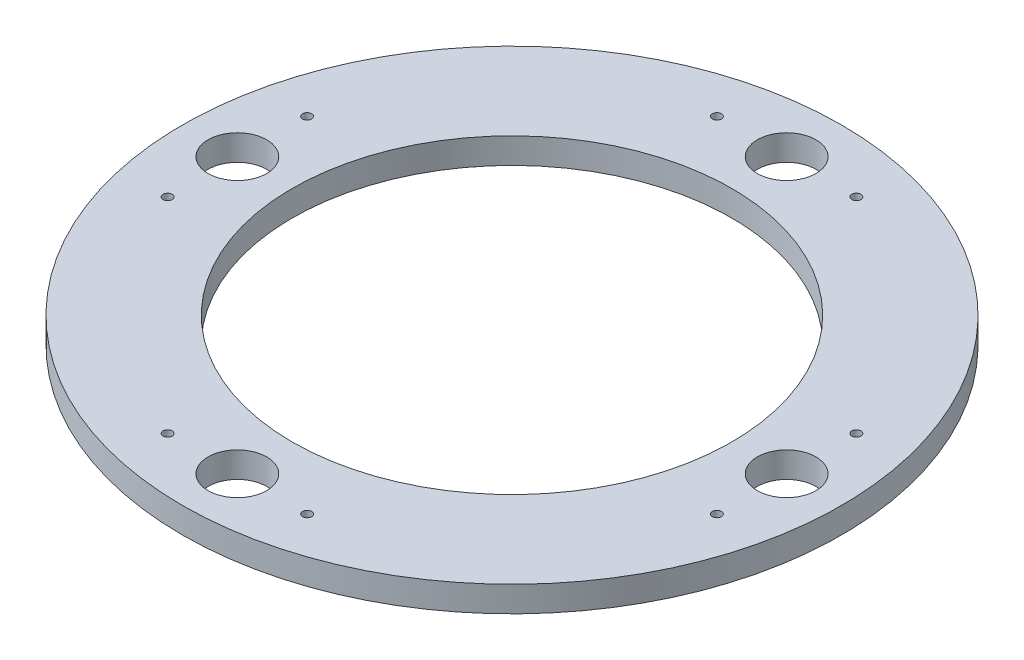
ISO-10303-21;
HEADER;
FILE_DESCRIPTION(('STEP AP214'),'2;1');
FILE_NAME('part.step','',(''),(''),'','','');
FILE_SCHEMA(('AUTOMOTIVE_DESIGN { 1 0 10303 214 1 1 1 1 }'));
ENDSEC;
DATA;
#1=APPLICATION_CONTEXT('core data for automotive mechanical design processes');
#2=APPLICATION_PROTOCOL_DEFINITION('international standard','automotive_design',2000,#1);
#3=PRODUCT_CONTEXT('',#1,'mechanical');
#4=PRODUCT('Part','Part','',(#3));
#5=PRODUCT_RELATED_PRODUCT_CATEGORY('part','',(#4));
#6=PRODUCT_DEFINITION_FORMATION('','',#4);
#7=PRODUCT_DEFINITION_CONTEXT('part definition',#1,'design');
#8=PRODUCT_DEFINITION('design','',#6,#7);
#9=PRODUCT_DEFINITION_SHAPE('','',#8);
#10=(LENGTH_UNIT() NAMED_UNIT(*) SI_UNIT(.MILLI.,.METRE.));
#11=(NAMED_UNIT(*) PLANE_ANGLE_UNIT() SI_UNIT($,.RADIAN.));
#12=(NAMED_UNIT(*) SI_UNIT($,.STERADIAN.) SOLID_ANGLE_UNIT());
#13=UNCERTAINTY_MEASURE_WITH_UNIT(LENGTH_MEASURE(1.E-05),#10,'distance_accuracy_value','');
#14=(GEOMETRIC_REPRESENTATION_CONTEXT(3) GLOBAL_UNCERTAINTY_ASSIGNED_CONTEXT((#13)) GLOBAL_UNIT_ASSIGNED_CONTEXT((#10,
#11,#12)) REPRESENTATION_CONTEXT('',''));
#15=CARTESIAN_POINT('',(0.,0.,0.));
#16=DIRECTION('',(0.,0.,1.));
#17=DIRECTION('',(1.,0.,0.));
#18=AXIS2_PLACEMENT_3D('',#15,#16,#17);
#19=CARTESIAN_POINT('',(0.,7.,0.));
#20=DIRECTION('',(0.,-1.,0.));
#21=DIRECTION('',(0.,0.,-1.));
#22=AXIS2_PLACEMENT_3D('',#19,#20,#21);
#23=CYLINDRICAL_SURFACE('',#22,90.);
#24=CARTESIAN_POINT('',(0.,7.,0.));
#25=DIRECTION('',(0.,1.,0.));
#26=DIRECTION('',(0.,0.,1.));
#27=AXIS2_PLACEMENT_3D('',#24,#25,#26);
#28=CIRCLE('',#27,90.);
#29=CARTESIAN_POINT('',(0.,7.,90.));
#30=VERTEX_POINT('',#29);
#31=EDGE_CURVE('E10',#30,#30,#28,.T.);
#32=ORIENTED_EDGE('',*,*,#31,.F.);
#33=EDGE_LOOP('',(#32));
#34=FACE_BOUND('',#33,.T.);
#35=CARTESIAN_POINT('',(0.,0.,0.));
#36=DIRECTION('',(0.,1.,0.));
#37=DIRECTION('',(0.,0.,1.));
#38=AXIS2_PLACEMENT_3D('',#35,#36,#37);
#39=CIRCLE('',#38,90.);
#40=CARTESIAN_POINT('',(0.,0.,90.));
#41=VERTEX_POINT('',#40);
#42=EDGE_CURVE('E39',#41,#41,#39,.T.);
#43=ORIENTED_EDGE('',*,*,#42,.T.);
#44=EDGE_LOOP('',(#43));
#45=FACE_BOUND('',#44,.T.);
#46=ADVANCED_FACE('F36',(#34,#45),#23,.T.);
#47=CARTESIAN_POINT('',(0.,7.,0.));
#48=DIRECTION('',(0.,1.,0.));
#49=DIRECTION('',(0.,0.,1.));
#50=AXIS2_PLACEMENT_3D('',#47,#48,#49);
#51=PLANE('',#50);
#52=CARTESIAN_POINT('',(0.,7.,0.));
#53=DIRECTION('',(0.,1.,0.));
#54=DIRECTION('',(0.,0.,1.));
#55=AXIS2_PLACEMENT_3D('',#52,#53,#54);
#56=CIRCLE('',#55,60.);
#57=CARTESIAN_POINT('',(0.,7.,60.));
#58=VERTEX_POINT('',#57);
#59=EDGE_CURVE('E120',#58,#58,#56,.T.);
#60=ORIENTED_EDGE('',*,*,#59,.F.);
#61=EDGE_LOOP('',(#60));
#62=FACE_BOUND('',#61,.T.);
#63=CARTESIAN_POINT('',(-75.0000000000002,7.,19.0499999999992));
#64=DIRECTION('',(0.,1.,0.));
#65=DIRECTION('',(0.,0.,1.));
#66=AXIS2_PLACEMENT_3D('',#63,#64,#65);
#67=CIRCLE('',#66,1.25);
#68=CARTESIAN_POINT('',(-75.0000000000002,7.,20.2999999999992));
#69=VERTEX_POINT('',#68);
#70=EDGE_CURVE('E116',#69,#69,#67,.T.);
#71=ORIENTED_EDGE('',*,*,#70,.F.);
#72=EDGE_LOOP('',(#71));
#73=FACE_BOUND('',#72,.T.);
#74=CARTESIAN_POINT('',(-74.9999999999998,7.,-19.0500000000008));
#75=DIRECTION('',(0.,1.,0.));
#76=DIRECTION('',(0.,0.,1.));
#77=AXIS2_PLACEMENT_3D('',#74,#75,#76);
#78=CIRCLE('',#77,1.25);
#79=CARTESIAN_POINT('',(-74.9999999999998,7.,-17.8000000000008));
#80=VERTEX_POINT('',#79);
#81=EDGE_CURVE('E110',#80,#80,#78,.T.);
#82=ORIENTED_EDGE('',*,*,#81,.F.);
#83=EDGE_LOOP('',(#82));
#84=FACE_BOUND('',#83,.T.);
#85=CARTESIAN_POINT('',(19.05,7.,75.));
#86=DIRECTION('',(0.,1.,0.));
#87=DIRECTION('',(0.,0.,1.));
#88=AXIS2_PLACEMENT_3D('',#85,#86,#87);
#89=CIRCLE('',#88,1.25);
#90=CARTESIAN_POINT('',(19.05,7.,76.25));
#91=VERTEX_POINT('',#90);
#92=EDGE_CURVE('E104',#91,#91,#89,.T.);
#93=ORIENTED_EDGE('',*,*,#92,.F.);
#94=EDGE_LOOP('',(#93));
#95=FACE_BOUND('',#94,.T.);
#96=CARTESIAN_POINT('',(-19.05,7.,75.));
#97=DIRECTION('',(0.,1.,0.));
#98=DIRECTION('',(0.,0.,1.));
#99=AXIS2_PLACEMENT_3D('',#96,#97,#98);
#100=CIRCLE('',#99,1.25);
#101=CARTESIAN_POINT('',(-19.05,7.,76.25));
#102=VERTEX_POINT('',#101);
#103=EDGE_CURVE('E98',#102,#102,#100,.T.);
#104=ORIENTED_EDGE('',*,*,#103,.F.);
#105=EDGE_LOOP('',(#104));
#106=FACE_BOUND('',#105,.T.);
#107=CARTESIAN_POINT('',(75.0000000000001,7.,-19.0499999999997));
#108=DIRECTION('',(0.,1.,0.));
#109=DIRECTION('',(0.,0.,1.));
#110=AXIS2_PLACEMENT_3D('',#107,#108,#109);
#111=CIRCLE('',#110,1.25);
#112=CARTESIAN_POINT('',(75.0000000000001,7.,-17.7999999999997));
#113=VERTEX_POINT('',#112);
#114=EDGE_CURVE('E92',#113,#113,#111,.T.);
#115=ORIENTED_EDGE('',*,*,#114,.F.);
#116=EDGE_LOOP('',(#115));
#117=FACE_BOUND('',#116,.T.);
#118=CARTESIAN_POINT('',(74.9999999999999,7.,19.0500000000003));
#119=DIRECTION('',(0.,1.,0.));
#120=DIRECTION('',(0.,0.,1.));
#121=AXIS2_PLACEMENT_3D('',#118,#119,#120);
#122=CIRCLE('',#121,1.25);
#123=CARTESIAN_POINT('',(74.9999999999999,7.,20.3000000000003));
#124=VERTEX_POINT('',#123);
#125=EDGE_CURVE('E86',#124,#124,#122,.T.);
#126=ORIENTED_EDGE('',*,*,#125,.F.);
#127=EDGE_LOOP('',(#126));
#128=FACE_BOUND('',#127,.T.);
#129=CARTESIAN_POINT('',(0.,7.,75.));
#130=DIRECTION('',(0.,1.,0.));
#131=DIRECTION('',(0.,0.,-1.));
#132=AXIS2_PLACEMENT_3D('',#129,#130,#131);
#133=CIRCLE('',#132,8.);
#134=CARTESIAN_POINT('',(0.,7.,67.));
#135=VERTEX_POINT('',#134);
#136=EDGE_CURVE('E79',#135,#135,#133,.T.);
#137=ORIENTED_EDGE('',*,*,#136,.F.);
#138=EDGE_LOOP('',(#137));
#139=FACE_BOUND('',#138,.T.);
#140=CARTESIAN_POINT('',(-75.,7.,-7.85583301239705E-13));
#141=DIRECTION('',(0.,1.,0.));
#142=DIRECTION('',(1.,0.,0.));
#143=AXIS2_PLACEMENT_3D('',#140,#141,#142);
#144=CIRCLE('',#143,8.);
#145=CARTESIAN_POINT('',(-67.,7.,-7.0178774910747E-13));
#146=VERTEX_POINT('',#145);
#147=EDGE_CURVE('E72',#146,#146,#144,.T.);
#148=ORIENTED_EDGE('',*,*,#147,.F.);
#149=EDGE_LOOP('',(#148));
#150=FACE_BOUND('',#149,.T.);
#151=CARTESIAN_POINT('',(75.,7.,2.61861100413235E-13));
#152=DIRECTION('',(0.,1.,0.));
#153=DIRECTION('',(-1.,0.,0.));
#154=AXIS2_PLACEMENT_3D('',#151,#152,#153);
#155=CIRCLE('',#154,8.);
#156=CARTESIAN_POINT('',(67.,7.,2.3392924970249E-13));
#157=VERTEX_POINT('',#156);
#158=EDGE_CURVE('E66',#157,#157,#155,.T.);
#159=ORIENTED_EDGE('',*,*,#158,.F.);
#160=EDGE_LOOP('',(#159));
#161=FACE_BOUND('',#160,.T.);
#162=CARTESIAN_POINT('',(-19.05,7.,-75.));
#163=DIRECTION('',(0.,1.,0.));
#164=DIRECTION('',(0.,0.,1.));
#165=AXIS2_PLACEMENT_3D('',#162,#163,#164);
#166=CIRCLE('',#165,1.25);
#167=CARTESIAN_POINT('',(-19.05,7.,-73.75));
#168=VERTEX_POINT('',#167);
#169=EDGE_CURVE('E62',#168,#168,#166,.T.);
#170=ORIENTED_EDGE('',*,*,#169,.F.);
#171=EDGE_LOOP('',(#170));
#172=FACE_BOUND('',#171,.T.);
#173=CARTESIAN_POINT('',(19.05,7.,-75.));
#174=DIRECTION('',(0.,1.,0.));
#175=DIRECTION('',(0.,0.,1.));
#176=AXIS2_PLACEMENT_3D('',#173,#174,#175);
#177=CIRCLE('',#176,1.25);
#178=CARTESIAN_POINT('',(19.05,7.,-73.75));
#179=VERTEX_POINT('',#178);
#180=EDGE_CURVE('E56',#179,#179,#177,.T.);
#181=ORIENTED_EDGE('',*,*,#180,.F.);
#182=EDGE_LOOP('',(#181));
#183=FACE_BOUND('',#182,.T.);
#184=CARTESIAN_POINT('',(0.,7.,-75.));
#185=DIRECTION('',(0.,1.,0.));
#186=DIRECTION('',(0.,0.,1.));
#187=AXIS2_PLACEMENT_3D('',#184,#185,#186);
#188=CIRCLE('',#187,8.);
#189=CARTESIAN_POINT('',(0.,7.,-67.));
#190=VERTEX_POINT('',#189);
#191=EDGE_CURVE('E48',#190,#190,#188,.T.);
#192=ORIENTED_EDGE('',*,*,#191,.F.);
#193=EDGE_LOOP('',(#192));
#194=FACE_BOUND('',#193,.T.);
#195=ORIENTED_EDGE('',*,*,#31,.T.);
#196=EDGE_LOOP('',(#195));
#197=FACE_BOUND('',#196,.T.);
#198=ADVANCED_FACE('F136',(#62,#73,#84,#95,#106,#117,#128,#139,#150,#161,#172,#183,#194,#197),
#51,.T.);
#199=CARTESIAN_POINT('',(0.,0.,0.));
#200=DIRECTION('',(0.,1.,0.));
#201=DIRECTION('',(0.,0.,1.));
#202=AXIS2_PLACEMENT_3D('',#199,#200,#201);
#203=PLANE('',#202);
#204=CARTESIAN_POINT('',(0.,0.,0.));
#205=DIRECTION('',(0.,1.,0.));
#206=DIRECTION('',(0.,0.,1.));
#207=AXIS2_PLACEMENT_3D('',#204,#205,#206);
#208=CIRCLE('',#207,60.);
#209=CARTESIAN_POINT('',(0.,0.,60.));
#210=VERTEX_POINT('',#209);
#211=EDGE_CURVE('E119',#210,#210,#208,.T.);
#212=ORIENTED_EDGE('',*,*,#211,.T.);
#213=EDGE_LOOP('',(#212));
#214=FACE_BOUND('',#213,.T.);
#215=CARTESIAN_POINT('',(-75.0000000000002,0.,19.0499999999992));
#216=DIRECTION('',(0.,1.,0.));
#217=DIRECTION('',(0.,0.,1.));
#218=AXIS2_PLACEMENT_3D('',#215,#216,#217);
#219=CIRCLE('',#218,1.25);
#220=CARTESIAN_POINT('',(-75.0000000000002,0.,20.2999999999992));
#221=VERTEX_POINT('',#220);
#222=EDGE_CURVE('E113',#221,#221,#219,.T.);
#223=ORIENTED_EDGE('',*,*,#222,.T.);
#224=EDGE_LOOP('',(#223));
#225=FACE_BOUND('',#224,.T.);
#226=CARTESIAN_POINT('',(-74.9999999999998,0.,-19.0500000000008));
#227=DIRECTION('',(0.,1.,0.));
#228=DIRECTION('',(0.,0.,1.));
#229=AXIS2_PLACEMENT_3D('',#226,#227,#228);
#230=CIRCLE('',#229,1.25);
#231=CARTESIAN_POINT('',(-74.9999999999998,0.,-17.8000000000008));
#232=VERTEX_POINT('',#231);
#233=EDGE_CURVE('E107',#232,#232,#230,.T.);
#234=ORIENTED_EDGE('',*,*,#233,.T.);
#235=EDGE_LOOP('',(#234));
#236=FACE_BOUND('',#235,.T.);
#237=CARTESIAN_POINT('',(19.05,0.,75.));
#238=DIRECTION('',(0.,1.,0.));
#239=DIRECTION('',(0.,0.,1.));
#240=AXIS2_PLACEMENT_3D('',#237,#238,#239);
#241=CIRCLE('',#240,1.25);
#242=CARTESIAN_POINT('',(19.05,0.,76.25));
#243=VERTEX_POINT('',#242);
#244=EDGE_CURVE('E101',#243,#243,#241,.T.);
#245=ORIENTED_EDGE('',*,*,#244,.T.);
#246=EDGE_LOOP('',(#245));
#247=FACE_BOUND('',#246,.T.);
#248=CARTESIAN_POINT('',(-19.05,0.,75.));
#249=DIRECTION('',(0.,1.,0.));
#250=DIRECTION('',(0.,0.,1.));
#251=AXIS2_PLACEMENT_3D('',#248,#249,#250);
#252=CIRCLE('',#251,1.25);
#253=CARTESIAN_POINT('',(-19.05,0.,76.25));
#254=VERTEX_POINT('',#253);
#255=EDGE_CURVE('E95',#254,#254,#252,.T.);
#256=ORIENTED_EDGE('',*,*,#255,.T.);
#257=EDGE_LOOP('',(#256));
#258=FACE_BOUND('',#257,.T.);
#259=CARTESIAN_POINT('',(75.0000000000001,0.,-19.0499999999997));
#260=DIRECTION('',(0.,1.,0.));
#261=DIRECTION('',(0.,0.,1.));
#262=AXIS2_PLACEMENT_3D('',#259,#260,#261);
#263=CIRCLE('',#262,1.25);
#264=CARTESIAN_POINT('',(75.0000000000001,0.,-17.7999999999997));
#265=VERTEX_POINT('',#264);
#266=EDGE_CURVE('E89',#265,#265,#263,.T.);
#267=ORIENTED_EDGE('',*,*,#266,.T.);
#268=EDGE_LOOP('',(#267));
#269=FACE_BOUND('',#268,.T.);
#270=CARTESIAN_POINT('',(74.9999999999999,0.,19.0500000000003));
#271=DIRECTION('',(0.,1.,0.));
#272=DIRECTION('',(0.,0.,1.));
#273=AXIS2_PLACEMENT_3D('',#270,#271,#272);
#274=CIRCLE('',#273,1.25);
#275=CARTESIAN_POINT('',(74.9999999999999,0.,20.3000000000003));
#276=VERTEX_POINT('',#275);
#277=EDGE_CURVE('E76',#276,#276,#274,.T.);
#278=ORIENTED_EDGE('',*,*,#277,.T.);
#279=EDGE_LOOP('',(#278));
#280=FACE_BOUND('',#279,.T.);
#281=CARTESIAN_POINT('',(0.,0.,75.));
#282=DIRECTION('',(0.,1.,0.));
#283=DIRECTION('',(0.,0.,-1.));
#284=AXIS2_PLACEMENT_3D('',#281,#282,#283);
#285=CIRCLE('',#284,8.);
#286=CARTESIAN_POINT('',(0.,0.,67.));
#287=VERTEX_POINT('',#286);
#288=EDGE_CURVE('E69',#287,#287,#285,.T.);
#289=ORIENTED_EDGE('',*,*,#288,.T.);
#290=EDGE_LOOP('',(#289));
#291=FACE_BOUND('',#290,.T.);
#292=CARTESIAN_POINT('',(-75.,0.,-7.85583301239705E-13));
#293=DIRECTION('',(0.,1.,0.));
#294=DIRECTION('',(1.,0.,0.));
#295=AXIS2_PLACEMENT_3D('',#292,#293,#294);
#296=CIRCLE('',#295,8.);
#297=CARTESIAN_POINT('',(-67.,0.,-7.0178774910747E-13));
#298=VERTEX_POINT('',#297);
#299=EDGE_CURVE('E75',#298,#298,#296,.T.);
#300=ORIENTED_EDGE('',*,*,#299,.T.);
#301=EDGE_LOOP('',(#300));
#302=FACE_BOUND('',#301,.T.);
#303=CARTESIAN_POINT('',(75.,0.,2.61861100413235E-13));
#304=DIRECTION('',(0.,1.,0.));
#305=DIRECTION('',(-1.,0.,0.));
#306=AXIS2_PLACEMENT_3D('',#303,#304,#305);
#307=CIRCLE('',#306,8.);
#308=CARTESIAN_POINT('',(67.,0.,2.3392924970249E-13));
#309=VERTEX_POINT('',#308);
#310=EDGE_CURVE('E65',#309,#309,#307,.T.);
#311=ORIENTED_EDGE('',*,*,#310,.T.);
#312=EDGE_LOOP('',(#311));
#313=FACE_BOUND('',#312,.T.);
#314=CARTESIAN_POINT('',(-19.05,0.,-75.));
#315=DIRECTION('',(0.,1.,0.));
#316=DIRECTION('',(0.,0.,1.));
#317=AXIS2_PLACEMENT_3D('',#314,#315,#316);
#318=CIRCLE('',#317,1.25);
#319=CARTESIAN_POINT('',(-19.05,0.,-73.75));
#320=VERTEX_POINT('',#319);
#321=EDGE_CURVE('E59',#320,#320,#318,.T.);
#322=ORIENTED_EDGE('',*,*,#321,.T.);
#323=EDGE_LOOP('',(#322));
#324=FACE_BOUND('',#323,.T.);
#325=CARTESIAN_POINT('',(19.05,0.,-75.));
#326=DIRECTION('',(0.,1.,0.));
#327=DIRECTION('',(0.,0.,1.));
#328=AXIS2_PLACEMENT_3D('',#325,#326,#327);
#329=CIRCLE('',#328,1.25);
#330=CARTESIAN_POINT('',(19.05,0.,-73.75));
#331=VERTEX_POINT('',#330);
#332=EDGE_CURVE('E51',#331,#331,#329,.T.);
#333=ORIENTED_EDGE('',*,*,#332,.T.);
#334=EDGE_LOOP('',(#333));
#335=FACE_BOUND('',#334,.T.);
#336=CARTESIAN_POINT('',(0.,0.,-75.));
#337=DIRECTION('',(0.,1.,0.));
#338=DIRECTION('',(0.,0.,1.));
#339=AXIS2_PLACEMENT_3D('',#336,#337,#338);
#340=CIRCLE('',#339,8.);
#341=CARTESIAN_POINT('',(0.,0.,-67.));
#342=VERTEX_POINT('',#341);
#343=EDGE_CURVE('E46',#342,#342,#340,.T.);
#344=ORIENTED_EDGE('',*,*,#343,.T.);
#345=EDGE_LOOP('',(#344));
#346=FACE_BOUND('',#345,.T.);
#347=ORIENTED_EDGE('',*,*,#42,.F.);
#348=EDGE_LOOP('',(#347));
#349=FACE_BOUND('',#348,.T.);
#350=ADVANCED_FACE('F126',(#214,#225,#236,#247,#258,#269,#280,#291,#302,#313,#324,#335,#346,
#349),#203,.F.);
#351=CARTESIAN_POINT('',(0.,0.,-75.));
#352=DIRECTION('',(0.,1.,0.));
#353=DIRECTION('',(0.,0.,1.));
#354=AXIS2_PLACEMENT_3D('',#351,#352,#353);
#355=CYLINDRICAL_SURFACE('',#354,8.);
#356=ORIENTED_EDGE('',*,*,#343,.F.);
#357=EDGE_LOOP('',(#356));
#358=FACE_BOUND('',#357,.T.);
#359=ORIENTED_EDGE('',*,*,#191,.T.);
#360=EDGE_LOOP('',(#359));
#361=FACE_BOUND('',#360,.T.);
#362=ADVANCED_FACE('F164',(#358,#361),#355,.F.);
#363=CARTESIAN_POINT('',(19.05,7.,-75.));
#364=DIRECTION('',(0.,1.,0.));
#365=DIRECTION('',(0.,0.,1.));
#366=AXIS2_PLACEMENT_3D('',#363,#364,#365);
#367=CYLINDRICAL_SURFACE('',#366,1.25);
#368=ORIENTED_EDGE('',*,*,#332,.F.);
#369=EDGE_LOOP('',(#368));
#370=FACE_BOUND('',#369,.T.);
#371=ORIENTED_EDGE('',*,*,#180,.T.);
#372=EDGE_LOOP('',(#371));
#373=FACE_BOUND('',#372,.T.);
#374=ADVANCED_FACE('F166',(#370,#373),#367,.F.);
#375=CARTESIAN_POINT('',(-19.05,7.,-75.));
#376=DIRECTION('',(0.,1.,0.));
#377=DIRECTION('',(0.,0.,1.));
#378=AXIS2_PLACEMENT_3D('',#375,#376,#377);
#379=CYLINDRICAL_SURFACE('',#378,1.25);
#380=ORIENTED_EDGE('',*,*,#321,.F.);
#381=EDGE_LOOP('',(#380));
#382=FACE_BOUND('',#381,.T.);
#383=ORIENTED_EDGE('',*,*,#169,.T.);
#384=EDGE_LOOP('',(#383));
#385=FACE_BOUND('',#384,.T.);
#386=ADVANCED_FACE('F173',(#382,#385),#379,.F.);
#387=CARTESIAN_POINT('',(75.,0.,2.61861100413235E-13));
#388=DIRECTION('',(0.,1.,0.));
#389=DIRECTION('',(0.,0.,1.));
#390=AXIS2_PLACEMENT_3D('',#387,#388,#389);
#391=CYLINDRICAL_SURFACE('',#390,8.);
#392=ORIENTED_EDGE('',*,*,#310,.F.);
#393=EDGE_LOOP('',(#392));
#394=FACE_BOUND('',#393,.T.);
#395=ORIENTED_EDGE('',*,*,#158,.T.);
#396=EDGE_LOOP('',(#395));
#397=FACE_BOUND('',#396,.T.);
#398=ADVANCED_FACE('F267',(#394,#397),#391,.F.);
#399=CARTESIAN_POINT('',(-75.,0.,-7.85583301239705E-13));
#400=DIRECTION('',(0.,1.,0.));
#401=DIRECTION('',(0.,0.,1.));
#402=AXIS2_PLACEMENT_3D('',#399,#400,#401);
#403=CYLINDRICAL_SURFACE('',#402,8.);
#404=ORIENTED_EDGE('',*,*,#299,.F.);
#405=EDGE_LOOP('',(#404));
#406=FACE_BOUND('',#405,.T.);
#407=ORIENTED_EDGE('',*,*,#147,.T.);
#408=EDGE_LOOP('',(#407));
#409=FACE_BOUND('',#408,.T.);
#410=ADVANCED_FACE('F259',(#406,#409),#403,.F.);
#411=CARTESIAN_POINT('',(0.,0.,75.));
#412=DIRECTION('',(0.,1.,0.));
#413=DIRECTION('',(0.,0.,1.));
#414=AXIS2_PLACEMENT_3D('',#411,#412,#413);
#415=CYLINDRICAL_SURFACE('',#414,8.);
#416=ORIENTED_EDGE('',*,*,#288,.F.);
#417=EDGE_LOOP('',(#416));
#418=FACE_BOUND('',#417,.T.);
#419=ORIENTED_EDGE('',*,*,#136,.T.);
#420=EDGE_LOOP('',(#419));
#421=FACE_BOUND('',#420,.T.);
#422=ADVANCED_FACE('F251',(#418,#421),#415,.F.);
#423=CARTESIAN_POINT('',(74.9999999999999,7.,19.0500000000003));
#424=DIRECTION('',(0.,1.,0.));
#425=DIRECTION('',(0.,0.,1.));
#426=AXIS2_PLACEMENT_3D('',#423,#424,#425);
#427=CYLINDRICAL_SURFACE('',#426,1.25);
#428=ORIENTED_EDGE('',*,*,#277,.F.);
#429=EDGE_LOOP('',(#428));
#430=FACE_BOUND('',#429,.T.);
#431=ORIENTED_EDGE('',*,*,#125,.T.);
#432=EDGE_LOOP('',(#431));
#433=FACE_BOUND('',#432,.T.);
#434=ADVANCED_FACE('F244',(#430,#433),#427,.F.);
#435=CARTESIAN_POINT('',(75.0000000000001,7.,-19.0499999999997));
#436=DIRECTION('',(0.,1.,0.));
#437=DIRECTION('',(0.,0.,1.));
#438=AXIS2_PLACEMENT_3D('',#435,#436,#437);
#439=CYLINDRICAL_SURFACE('',#438,1.25);
#440=ORIENTED_EDGE('',*,*,#266,.F.);
#441=EDGE_LOOP('',(#440));
#442=FACE_BOUND('',#441,.T.);
#443=ORIENTED_EDGE('',*,*,#114,.T.);
#444=EDGE_LOOP('',(#443));
#445=FACE_BOUND('',#444,.T.);
#446=ADVANCED_FACE('F236',(#442,#445),#439,.F.);
#447=CARTESIAN_POINT('',(-19.05,7.,75.));
#448=DIRECTION('',(0.,1.,0.));
#449=DIRECTION('',(0.,0.,1.));
#450=AXIS2_PLACEMENT_3D('',#447,#448,#449);
#451=CYLINDRICAL_SURFACE('',#450,1.25);
#452=ORIENTED_EDGE('',*,*,#255,.F.);
#453=EDGE_LOOP('',(#452));
#454=FACE_BOUND('',#453,.T.);
#455=ORIENTED_EDGE('',*,*,#103,.T.);
#456=EDGE_LOOP('',(#455));
#457=FACE_BOUND('',#456,.T.);
#458=ADVANCED_FACE('F229',(#454,#457),#451,.F.);
#459=CARTESIAN_POINT('',(19.05,7.,75.));
#460=DIRECTION('',(0.,1.,0.));
#461=DIRECTION('',(0.,0.,1.));
#462=AXIS2_PLACEMENT_3D('',#459,#460,#461);
#463=CYLINDRICAL_SURFACE('',#462,1.25);
#464=ORIENTED_EDGE('',*,*,#244,.F.);
#465=EDGE_LOOP('',(#464));
#466=FACE_BOUND('',#465,.T.);
#467=ORIENTED_EDGE('',*,*,#92,.T.);
#468=EDGE_LOOP('',(#467));
#469=FACE_BOUND('',#468,.T.);
#470=ADVANCED_FACE('F220',(#466,#469),#463,.F.);
#471=CARTESIAN_POINT('',(-74.9999999999998,7.,-19.0500000000008));
#472=DIRECTION('',(0.,1.,0.));
#473=DIRECTION('',(0.,0.,1.));
#474=AXIS2_PLACEMENT_3D('',#471,#472,#473);
#475=CYLINDRICAL_SURFACE('',#474,1.25);
#476=ORIENTED_EDGE('',*,*,#233,.F.);
#477=EDGE_LOOP('',(#476));
#478=FACE_BOUND('',#477,.T.);
#479=ORIENTED_EDGE('',*,*,#81,.T.);
#480=EDGE_LOOP('',(#479));
#481=FACE_BOUND('',#480,.T.);
#482=ADVANCED_FACE('F212',(#478,#481),#475,.F.);
#483=CARTESIAN_POINT('',(-75.0000000000002,7.,19.0499999999992));
#484=DIRECTION('',(0.,1.,0.));
#485=DIRECTION('',(0.,0.,1.));
#486=AXIS2_PLACEMENT_3D('',#483,#484,#485);
#487=CYLINDRICAL_SURFACE('',#486,1.25);
#488=ORIENTED_EDGE('',*,*,#222,.F.);
#489=EDGE_LOOP('',(#488));
#490=FACE_BOUND('',#489,.T.);
#491=ORIENTED_EDGE('',*,*,#70,.T.);
#492=EDGE_LOOP('',(#491));
#493=FACE_BOUND('',#492,.T.);
#494=ADVANCED_FACE('F132',(#490,#493),#487,.F.);
#495=CARTESIAN_POINT('',(0.,0.,0.));
#496=DIRECTION('',(0.,1.,0.));
#497=DIRECTION('',(0.,0.,1.));
#498=AXIS2_PLACEMENT_3D('',#495,#496,#497);
#499=CYLINDRICAL_SURFACE('',#498,60.);
#500=ORIENTED_EDGE('',*,*,#211,.F.);
#501=EDGE_LOOP('',(#500));
#502=FACE_BOUND('',#501,.T.);
#503=ORIENTED_EDGE('',*,*,#59,.T.);
#504=EDGE_LOOP('',(#503));
#505=FACE_BOUND('',#504,.T.);
#506=ADVANCED_FACE('F129',(#502,#505),#499,.F.);
#507=CLOSED_SHELL('',(#46,#198,#350,#362,#374,#386,#398,#410,#422,#434,#446,#458,#470,#482,#494,#506));
#508=MANIFOLD_SOLID_BREP('B2',#507);
#509=ADVANCED_BREP_SHAPE_REPRESENTATION('',(#18,#508),#14);
#510=SHAPE_DEFINITION_REPRESENTATION(#9,#509);
ENDSEC;
END-ISO-10303-21;
